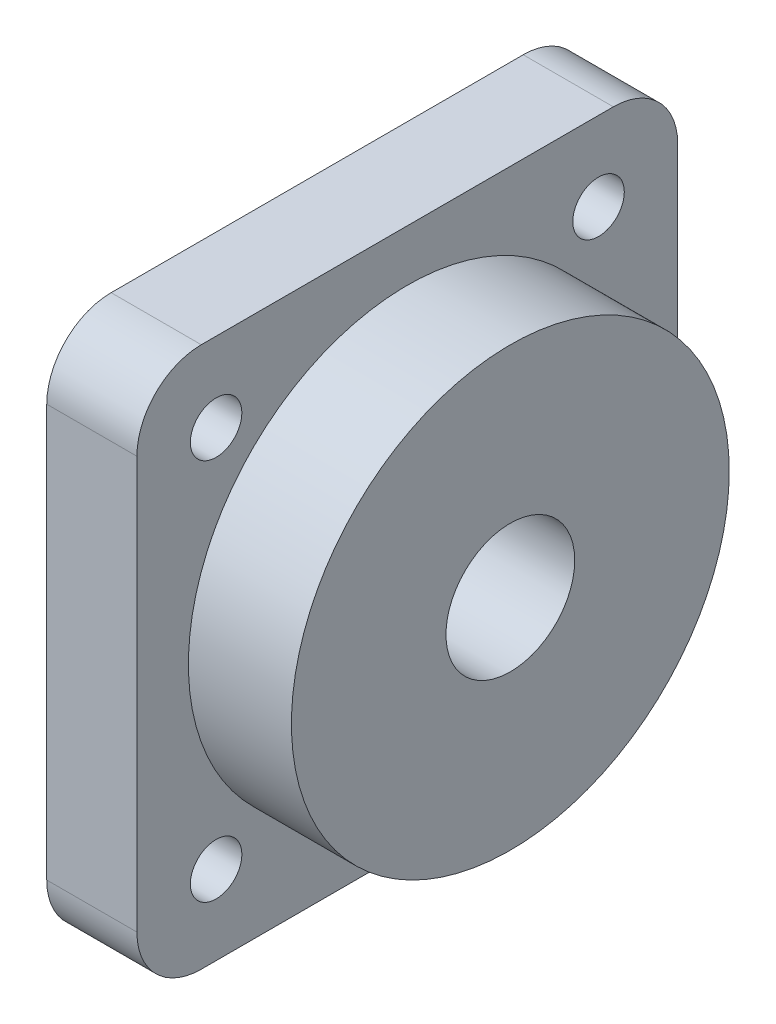
ISO-10303-21;
HEADER;
FILE_DESCRIPTION(('STEP AP214'),'2;1');
FILE_NAME('part.step','',(''),(''),'','','');
FILE_SCHEMA(('AUTOMOTIVE_DESIGN { 1 0 10303 214 1 1 1 1 }'));
ENDSEC;
DATA;
#1=APPLICATION_CONTEXT('core data for automotive mechanical design processes');
#2=APPLICATION_PROTOCOL_DEFINITION('international standard','automotive_design',2000,#1);
#3=PRODUCT_CONTEXT('',#1,'mechanical');
#4=PRODUCT('Part','Part','',(#3));
#5=PRODUCT_RELATED_PRODUCT_CATEGORY('part','',(#4));
#6=PRODUCT_DEFINITION_FORMATION('','',#4);
#7=PRODUCT_DEFINITION_CONTEXT('part definition',#1,'design');
#8=PRODUCT_DEFINITION('design','',#6,#7);
#9=PRODUCT_DEFINITION_SHAPE('','',#8);
#10=(LENGTH_UNIT() NAMED_UNIT(*) SI_UNIT(.MILLI.,.METRE.));
#11=(NAMED_UNIT(*) PLANE_ANGLE_UNIT() SI_UNIT($,.RADIAN.));
#12=(NAMED_UNIT(*) SI_UNIT($,.STERADIAN.) SOLID_ANGLE_UNIT());
#13=UNCERTAINTY_MEASURE_WITH_UNIT(LENGTH_MEASURE(1.E-05),#10,'distance_accuracy_value','');
#14=(GEOMETRIC_REPRESENTATION_CONTEXT(3) GLOBAL_UNCERTAINTY_ASSIGNED_CONTEXT((#13)) GLOBAL_UNIT_ASSIGNED_CONTEXT((#10,
#11,#12)) REPRESENTATION_CONTEXT('',''));
#15=CARTESIAN_POINT('',(0.,0.,0.));
#16=DIRECTION('',(0.,0.,1.));
#17=DIRECTION('',(1.,0.,0.));
#18=AXIS2_PLACEMENT_3D('',#15,#16,#17);
#19=CARTESIAN_POINT('',(7.,0.,0.));
#20=DIRECTION('',(1.,0.,0.));
#21=DIRECTION('',(0.,0.,-1.));
#22=AXIS2_PLACEMENT_3D('',#19,#20,#21);
#23=PLANE('',#22);
#24=CARTESIAN_POINT('',(7.,-14.8492424049175,-14.8492424049175));
#25=DIRECTION('',(1.,0.,0.));
#26=DIRECTION('',(0.,0.,-1.));
#27=AXIS2_PLACEMENT_3D('',#24,#25,#26);
#28=CIRCLE('',#27,2.);
#29=CARTESIAN_POINT('',(7.,-14.8492424049175,-16.8492424049175));
#30=VERTEX_POINT('',#29);
#31=EDGE_CURVE('E185',#30,#30,#28,.T.);
#32=ORIENTED_EDGE('',*,*,#31,.F.);
#33=EDGE_LOOP('',(#32));
#34=FACE_BOUND('',#33,.T.);
#35=CARTESIAN_POINT('',(7.,14.8492424049175,14.8492424049175));
#36=DIRECTION('',(1.,0.,0.));
#37=DIRECTION('',(0.,0.,-1.));
#38=AXIS2_PLACEMENT_3D('',#35,#36,#37);
#39=CIRCLE('',#38,2.);
#40=CARTESIAN_POINT('',(7.,14.8492424049175,12.8492424049175));
#41=VERTEX_POINT('',#40);
#42=EDGE_CURVE('E126',#41,#41,#39,.T.);
#43=ORIENTED_EDGE('',*,*,#42,.F.);
#44=EDGE_LOOP('',(#43));
#45=FACE_BOUND('',#44,.T.);
#46=DIRECTION('',(0.,0.,1.));
#47=VECTOR('',#46,1.);
#48=CARTESIAN_POINT('',(7.,21.,-21.));
#49=LINE('',#48,#47);
#50=CARTESIAN_POINT('',(7.,21.,-16.));
#51=VERTEX_POINT('',#50);
#52=CARTESIAN_POINT('',(7.,21.,16.));
#53=VERTEX_POINT('',#52);
#54=EDGE_CURVE('E135',#51,#53,#49,.T.);
#55=ORIENTED_EDGE('',*,*,#54,.T.);
#56=CARTESIAN_POINT('',(7.,16.,16.));
#57=DIRECTION('',(1.,0.,0.));
#58=DIRECTION('',(0.,0.,-1.));
#59=AXIS2_PLACEMENT_3D('',#56,#57,#58);
#60=CIRCLE('',#59,5.);
#61=CARTESIAN_POINT('',(7.,16.,21.));
#62=VERTEX_POINT('',#61);
#63=EDGE_CURVE('E154',#53,#62,#60,.T.);
#64=ORIENTED_EDGE('',*,*,#63,.T.);
#65=DIRECTION('',(0.,-1.,0.));
#66=VECTOR('',#65,1.);
#67=CARTESIAN_POINT('',(7.,-21.,21.));
#68=LINE('',#67,#66);
#69=CARTESIAN_POINT('',(7.,-16.,21.));
#70=VERTEX_POINT('',#69);
#71=EDGE_CURVE('E118',#62,#70,#68,.T.);
#72=ORIENTED_EDGE('',*,*,#71,.T.);
#73=CARTESIAN_POINT('',(7.,-16.,16.));
#74=DIRECTION('',(1.,0.,0.));
#75=DIRECTION('',(0.,0.,-1.));
#76=AXIS2_PLACEMENT_3D('',#73,#74,#75);
#77=CIRCLE('',#76,5.);
#78=CARTESIAN_POINT('',(7.,-21.,16.));
#79=VERTEX_POINT('',#78);
#80=EDGE_CURVE('E149',#70,#79,#77,.T.);
#81=ORIENTED_EDGE('',*,*,#80,.T.);
#82=DIRECTION('',(0.,0.,-1.));
#83=VECTOR('',#82,1.);
#84=CARTESIAN_POINT('',(7.,-21.,-21.));
#85=LINE('',#84,#83);
#86=CARTESIAN_POINT('',(7.,-21.,-16.));
#87=VERTEX_POINT('',#86);
#88=EDGE_CURVE('E165',#79,#87,#85,.T.);
#89=ORIENTED_EDGE('',*,*,#88,.T.);
#90=CARTESIAN_POINT('',(7.,-16.,-16.));
#91=DIRECTION('',(1.,0.,0.));
#92=DIRECTION('',(0.,0.,-1.));
#93=AXIS2_PLACEMENT_3D('',#90,#91,#92);
#94=CIRCLE('',#93,5.);
#95=CARTESIAN_POINT('',(7.,-16.,-21.));
#96=VERTEX_POINT('',#95);
#97=EDGE_CURVE('E54',#87,#96,#94,.T.);
#98=ORIENTED_EDGE('',*,*,#97,.T.);
#99=DIRECTION('',(0.,1.,0.));
#100=VECTOR('',#99,1.);
#101=CARTESIAN_POINT('',(7.,-21.,-21.));
#102=LINE('',#101,#100);
#103=CARTESIAN_POINT('',(7.,16.,-21.));
#104=VERTEX_POINT('',#103);
#105=EDGE_CURVE('E173',#96,#104,#102,.T.);
#106=ORIENTED_EDGE('',*,*,#105,.T.);
#107=CARTESIAN_POINT('',(7.,16.,-16.));
#108=DIRECTION('',(1.,0.,0.));
#109=DIRECTION('',(0.,0.,-1.));
#110=AXIS2_PLACEMENT_3D('',#107,#108,#109);
#111=CIRCLE('',#110,5.);
#112=EDGE_CURVE('E152',#104,#51,#111,.T.);
#113=ORIENTED_EDGE('',*,*,#112,.T.);
#114=EDGE_LOOP('',(#55,#64,#72,#81,#89,#98,#106,#113));
#115=FACE_BOUND('',#114,.T.);
#116=CARTESIAN_POINT('',(7.,14.8492424049175,-14.8492424049175));
#117=DIRECTION('',(1.,0.,0.));
#118=DIRECTION('',(0.,0.,-1.));
#119=AXIS2_PLACEMENT_3D('',#116,#117,#118);
#120=CIRCLE('',#119,2.);
#121=CARTESIAN_POINT('',(7.,14.8492424049175,-16.8492424049175));
#122=VERTEX_POINT('',#121);
#123=EDGE_CURVE('E180',#122,#122,#120,.T.);
#124=ORIENTED_EDGE('',*,*,#123,.F.);
#125=EDGE_LOOP('',(#124));
#126=FACE_BOUND('',#125,.T.);
#127=CARTESIAN_POINT('',(7.,-14.8492424049175,14.8492424049175));
#128=DIRECTION('',(1.,0.,0.));
#129=DIRECTION('',(0.,0.,-1.));
#130=AXIS2_PLACEMENT_3D('',#127,#128,#129);
#131=CIRCLE('',#130,2.);
#132=CARTESIAN_POINT('',(7.,-14.8492424049175,12.8492424049175));
#133=VERTEX_POINT('',#132);
#134=EDGE_CURVE('E191',#133,#133,#131,.T.);
#135=ORIENTED_EDGE('',*,*,#134,.F.);
#136=EDGE_LOOP('',(#135));
#137=FACE_BOUND('',#136,.T.);
#138=CARTESIAN_POINT('',(7.,0.,0.));
#139=DIRECTION('',(1.,0.,0.));
#140=DIRECTION('',(0.,0.,-1.));
#141=AXIS2_PLACEMENT_3D('',#138,#139,#140);
#142=CIRCLE('',#141,17.);
#143=CARTESIAN_POINT('',(7.,0.,-17.));
#144=VERTEX_POINT('',#143);
#145=EDGE_CURVE('E197',#144,#144,#142,.F.);
#146=ORIENTED_EDGE('',*,*,#145,.T.);
#147=EDGE_LOOP('',(#146));
#148=FACE_BOUND('',#147,.T.);
#149=ADVANCED_FACE('F32',(#34,#45,#115,#126,#137,#148),#23,.T.);
#150=CARTESIAN_POINT('',(0.,0.,0.));
#151=DIRECTION('',(1.,0.,0.));
#152=DIRECTION('',(0.,0.,-1.));
#153=AXIS2_PLACEMENT_3D('',#150,#151,#152);
#154=PLANE('',#153);
#155=CARTESIAN_POINT('',(0.,0.,0.));
#156=DIRECTION('',(1.,0.,0.));
#157=DIRECTION('',(0.,0.,-1.));
#158=AXIS2_PLACEMENT_3D('',#155,#156,#157);
#159=CIRCLE('',#158,5.);
#160=CARTESIAN_POINT('',(0.,0.,-5.));
#161=VERTEX_POINT('',#160);
#162=EDGE_CURVE('E206',#161,#161,#159,.T.);
#163=ORIENTED_EDGE('',*,*,#162,.T.);
#164=EDGE_LOOP('',(#163));
#165=FACE_BOUND('',#164,.T.);
#166=CARTESIAN_POINT('',(0.,-14.8492424049175,-14.8492424049175));
#167=DIRECTION('',(1.,0.,0.));
#168=DIRECTION('',(0.,0.,-1.));
#169=AXIS2_PLACEMENT_3D('',#166,#167,#168);
#170=CIRCLE('',#169,2.);
#171=CARTESIAN_POINT('',(0.,-14.8492424049175,-16.8492424049175));
#172=VERTEX_POINT('',#171);
#173=EDGE_CURVE('E188',#172,#172,#170,.T.);
#174=ORIENTED_EDGE('',*,*,#173,.T.);
#175=EDGE_LOOP('',(#174));
#176=FACE_BOUND('',#175,.T.);
#177=CARTESIAN_POINT('',(0.,14.8492424049175,14.8492424049175));
#178=DIRECTION('',(1.,0.,0.));
#179=DIRECTION('',(0.,0.,-1.));
#180=AXIS2_PLACEMENT_3D('',#177,#178,#179);
#181=CIRCLE('',#180,2.);
#182=CARTESIAN_POINT('',(0.,14.8492424049175,12.8492424049175));
#183=VERTEX_POINT('',#182);
#184=EDGE_CURVE('E132',#183,#183,#181,.T.);
#185=ORIENTED_EDGE('',*,*,#184,.T.);
#186=EDGE_LOOP('',(#185));
#187=FACE_BOUND('',#186,.T.);
#188=DIRECTION('',(0.,-1.,0.));
#189=VECTOR('',#188,1.);
#190=CARTESIAN_POINT('',(0.,-21.,21.));
#191=LINE('',#190,#189);
#192=CARTESIAN_POINT('',(0.,16.,21.));
#193=VERTEX_POINT('',#192);
#194=CARTESIAN_POINT('',(0.,-16.,21.));
#195=VERTEX_POINT('',#194);
#196=EDGE_CURVE('E115',#193,#195,#191,.T.);
#197=ORIENTED_EDGE('',*,*,#196,.F.);
#198=CARTESIAN_POINT('',(0.,16.,16.));
#199=DIRECTION('',(1.,0.,0.));
#200=DIRECTION('',(0.,0.,-1.));
#201=AXIS2_PLACEMENT_3D('',#198,#199,#200);
#202=CIRCLE('',#201,5.);
#203=CARTESIAN_POINT('',(0.,21.,16.));
#204=VERTEX_POINT('',#203);
#205=EDGE_CURVE('E98',#193,#204,#202,.F.);
#206=ORIENTED_EDGE('',*,*,#205,.T.);
#207=DIRECTION('',(0.,0.,1.));
#208=VECTOR('',#207,1.);
#209=CARTESIAN_POINT('',(0.,21.,-21.));
#210=LINE('',#209,#208);
#211=CARTESIAN_POINT('',(0.,21.,-16.));
#212=VERTEX_POINT('',#211);
#213=EDGE_CURVE('E139',#212,#204,#210,.T.);
#214=ORIENTED_EDGE('',*,*,#213,.F.);
#215=CARTESIAN_POINT('',(0.,16.,-16.));
#216=DIRECTION('',(1.,0.,0.));
#217=DIRECTION('',(0.,0.,-1.));
#218=AXIS2_PLACEMENT_3D('',#215,#216,#217);
#219=CIRCLE('',#218,5.);
#220=CARTESIAN_POINT('',(0.,16.,-21.));
#221=VERTEX_POINT('',#220);
#222=EDGE_CURVE('E109',#212,#221,#219,.F.);
#223=ORIENTED_EDGE('',*,*,#222,.T.);
#224=DIRECTION('',(0.,1.,0.));
#225=VECTOR('',#224,1.);
#226=CARTESIAN_POINT('',(0.,-21.,-21.));
#227=LINE('',#226,#225);
#228=CARTESIAN_POINT('',(0.,-16.,-21.));
#229=VERTEX_POINT('',#228);
#230=EDGE_CURVE('E129',#229,#221,#227,.T.);
#231=ORIENTED_EDGE('',*,*,#230,.F.);
#232=CARTESIAN_POINT('',(0.,-16.,-16.));
#233=DIRECTION('',(1.,0.,0.));
#234=DIRECTION('',(0.,0.,-1.));
#235=AXIS2_PLACEMENT_3D('',#232,#233,#234);
#236=CIRCLE('',#235,5.);
#237=CARTESIAN_POINT('',(0.,-21.,-16.));
#238=VERTEX_POINT('',#237);
#239=EDGE_CURVE('E143',#229,#238,#236,.F.);
#240=ORIENTED_EDGE('',*,*,#239,.T.);
#241=DIRECTION('',(0.,0.,-1.));
#242=VECTOR('',#241,1.);
#243=CARTESIAN_POINT('',(0.,-21.,-21.));
#244=LINE('',#243,#242);
#245=CARTESIAN_POINT('',(0.,-21.,16.));
#246=VERTEX_POINT('',#245);
#247=EDGE_CURVE('E125',#246,#238,#244,.T.);
#248=ORIENTED_EDGE('',*,*,#247,.F.);
#249=CARTESIAN_POINT('',(0.,-16.,16.));
#250=DIRECTION('',(1.,0.,0.));
#251=DIRECTION('',(0.,0.,-1.));
#252=AXIS2_PLACEMENT_3D('',#249,#250,#251);
#253=CIRCLE('',#252,5.);
#254=EDGE_CURVE('E119',#246,#195,#253,.F.);
#255=ORIENTED_EDGE('',*,*,#254,.T.);
#256=EDGE_LOOP('',(#197,#206,#214,#223,#231,#240,#248,#255));
#257=FACE_BOUND('',#256,.T.);
#258=CARTESIAN_POINT('',(0.,14.8492424049175,-14.8492424049175));
#259=DIRECTION('',(1.,0.,0.));
#260=DIRECTION('',(0.,0.,-1.));
#261=AXIS2_PLACEMENT_3D('',#258,#259,#260);
#262=CIRCLE('',#261,2.);
#263=CARTESIAN_POINT('',(0.,14.8492424049175,-16.8492424049175));
#264=VERTEX_POINT('',#263);
#265=EDGE_CURVE('E182',#264,#264,#262,.T.);
#266=ORIENTED_EDGE('',*,*,#265,.T.);
#267=EDGE_LOOP('',(#266));
#268=FACE_BOUND('',#267,.T.);
#269=CARTESIAN_POINT('',(0.,-14.8492424049175,14.8492424049175));
#270=DIRECTION('',(1.,0.,0.));
#271=DIRECTION('',(0.,0.,-1.));
#272=AXIS2_PLACEMENT_3D('',#269,#270,#271);
#273=CIRCLE('',#272,2.);
#274=CARTESIAN_POINT('',(0.,-14.8492424049175,12.8492424049175));
#275=VERTEX_POINT('',#274);
#276=EDGE_CURVE('E194',#275,#275,#273,.T.);
#277=ORIENTED_EDGE('',*,*,#276,.T.);
#278=EDGE_LOOP('',(#277));
#279=FACE_BOUND('',#278,.T.);
#280=ADVANCED_FACE('F122',(#165,#176,#187,#257,#268,#279),#154,.F.);
#281=CARTESIAN_POINT('',(7.,-21.,21.));
#282=DIRECTION('',(0.,0.,-1.));
#283=DIRECTION('',(-1.,0.,0.));
#284=AXIS2_PLACEMENT_3D('',#281,#282,#283);
#285=PLANE('',#284);
#286=ORIENTED_EDGE('',*,*,#71,.F.);
#287=DIRECTION('',(-1.,0.,0.));
#288=VECTOR('',#287,1.);
#289=CARTESIAN_POINT('',(7.,16.,21.));
#290=LINE('',#289,#288);
#291=EDGE_CURVE('E102',#62,#193,#290,.T.);
#292=ORIENTED_EDGE('',*,*,#291,.T.);
#293=ORIENTED_EDGE('',*,*,#196,.T.);
#294=DIRECTION('',(-1.,0.,0.));
#295=VECTOR('',#294,1.);
#296=CARTESIAN_POINT('',(7.,-16.,21.));
#297=LINE('',#296,#295);
#298=EDGE_CURVE('E120',#195,#70,#297,.F.);
#299=ORIENTED_EDGE('',*,*,#298,.T.);
#300=EDGE_LOOP('',(#286,#292,#293,#299));
#301=FACE_BOUND('',#300,.T.);
#302=ADVANCED_FACE('F114',(#301),#285,.F.);
#303=CARTESIAN_POINT('',(7.,-21.,-21.));
#304=DIRECTION('',(0.,1.,0.));
#305=DIRECTION('',(0.,0.,1.));
#306=AXIS2_PLACEMENT_3D('',#303,#304,#305);
#307=PLANE('',#306);
#308=ORIENTED_EDGE('',*,*,#247,.T.);
#309=DIRECTION('',(-1.,0.,0.));
#310=VECTOR('',#309,1.);
#311=CARTESIAN_POINT('',(7.,-21.,-16.));
#312=LINE('',#311,#310);
#313=EDGE_CURVE('E11',#238,#87,#312,.F.);
#314=ORIENTED_EDGE('',*,*,#313,.T.);
#315=ORIENTED_EDGE('',*,*,#88,.F.);
#316=DIRECTION('',(-1.,0.,0.));
#317=VECTOR('',#316,1.);
#318=CARTESIAN_POINT('',(7.,-21.,16.));
#319=LINE('',#318,#317);
#320=EDGE_CURVE('E40',#79,#246,#319,.T.);
#321=ORIENTED_EDGE('',*,*,#320,.T.);
#322=EDGE_LOOP('',(#308,#314,#315,#321));
#323=FACE_BOUND('',#322,.T.);
#324=ADVANCED_FACE('F163',(#323),#307,.F.);
#325=CARTESIAN_POINT('',(7.,-21.,-21.));
#326=DIRECTION('',(0.,0.,1.));
#327=DIRECTION('',(0.,-1.,0.));
#328=AXIS2_PLACEMENT_3D('',#325,#326,#327);
#329=PLANE('',#328);
#330=ORIENTED_EDGE('',*,*,#230,.T.);
#331=DIRECTION('',(-1.,0.,0.));
#332=VECTOR('',#331,1.);
#333=CARTESIAN_POINT('',(7.,16.,-21.));
#334=LINE('',#333,#332);
#335=EDGE_CURVE('E47',#221,#104,#334,.F.);
#336=ORIENTED_EDGE('',*,*,#335,.T.);
#337=ORIENTED_EDGE('',*,*,#105,.F.);
#338=DIRECTION('',(-1.,0.,0.));
#339=VECTOR('',#338,1.);
#340=CARTESIAN_POINT('',(7.,-16.,-21.));
#341=LINE('',#340,#339);
#342=EDGE_CURVE('E156',#96,#229,#341,.T.);
#343=ORIENTED_EDGE('',*,*,#342,.T.);
#344=EDGE_LOOP('',(#330,#336,#337,#343));
#345=FACE_BOUND('',#344,.T.);
#346=ADVANCED_FACE('F172',(#345),#329,.F.);
#347=CARTESIAN_POINT('',(7.,21.,-21.));
#348=DIRECTION('',(0.,-1.,0.));
#349=DIRECTION('',(0.,0.,-1.));
#350=AXIS2_PLACEMENT_3D('',#347,#348,#349);
#351=PLANE('',#350);
#352=ORIENTED_EDGE('',*,*,#213,.T.);
#353=DIRECTION('',(-1.,0.,0.));
#354=VECTOR('',#353,1.);
#355=CARTESIAN_POINT('',(7.,21.,16.));
#356=LINE('',#355,#354);
#357=EDGE_CURVE('E103',#204,#53,#356,.F.);
#358=ORIENTED_EDGE('',*,*,#357,.T.);
#359=ORIENTED_EDGE('',*,*,#54,.F.);
#360=DIRECTION('',(-1.,0.,0.));
#361=VECTOR('',#360,1.);
#362=CARTESIAN_POINT('',(7.,21.,-16.));
#363=LINE('',#362,#361);
#364=EDGE_CURVE('E108',#51,#212,#363,.T.);
#365=ORIENTED_EDGE('',*,*,#364,.T.);
#366=EDGE_LOOP('',(#352,#358,#359,#365));
#367=FACE_BOUND('',#366,.T.);
#368=ADVANCED_FACE('F245',(#367),#351,.F.);
#369=CARTESIAN_POINT('',(7.,14.8492424049175,14.8492424049175));
#370=DIRECTION('',(-1.,0.,0.));
#371=DIRECTION('',(0.,0.,1.));
#372=AXIS2_PLACEMENT_3D('',#369,#370,#371);
#373=CYLINDRICAL_SURFACE('',#372,2.);
#374=ORIENTED_EDGE('',*,*,#42,.T.);
#375=EDGE_LOOP('',(#374));
#376=FACE_BOUND('',#375,.T.);
#377=ORIENTED_EDGE('',*,*,#184,.F.);
#378=EDGE_LOOP('',(#377));
#379=FACE_BOUND('',#378,.T.);
#380=ADVANCED_FACE('F242',(#376,#379),#373,.F.);
#381=CARTESIAN_POINT('',(7.,14.8492424049175,-14.8492424049175));
#382=DIRECTION('',(-1.,0.,0.));
#383=DIRECTION('',(0.,0.,1.));
#384=AXIS2_PLACEMENT_3D('',#381,#382,#383);
#385=CYLINDRICAL_SURFACE('',#384,2.);
#386=ORIENTED_EDGE('',*,*,#123,.T.);
#387=EDGE_LOOP('',(#386));
#388=FACE_BOUND('',#387,.T.);
#389=ORIENTED_EDGE('',*,*,#265,.F.);
#390=EDGE_LOOP('',(#389));
#391=FACE_BOUND('',#390,.T.);
#392=ADVANCED_FACE('F280',(#388,#391),#385,.F.);
#393=CARTESIAN_POINT('',(7.,-14.8492424049175,-14.8492424049175));
#394=DIRECTION('',(-1.,0.,0.));
#395=DIRECTION('',(0.,0.,1.));
#396=AXIS2_PLACEMENT_3D('',#393,#394,#395);
#397=CYLINDRICAL_SURFACE('',#396,2.);
#398=ORIENTED_EDGE('',*,*,#31,.T.);
#399=EDGE_LOOP('',(#398));
#400=FACE_BOUND('',#399,.T.);
#401=ORIENTED_EDGE('',*,*,#173,.F.);
#402=EDGE_LOOP('',(#401));
#403=FACE_BOUND('',#402,.T.);
#404=ADVANCED_FACE('F227',(#400,#403),#397,.F.);
#405=CARTESIAN_POINT('',(7.,-14.8492424049175,14.8492424049175));
#406=DIRECTION('',(-1.,0.,0.));
#407=DIRECTION('',(0.,0.,1.));
#408=AXIS2_PLACEMENT_3D('',#405,#406,#407);
#409=CYLINDRICAL_SURFACE('',#408,2.);
#410=ORIENTED_EDGE('',*,*,#134,.T.);
#411=EDGE_LOOP('',(#410));
#412=FACE_BOUND('',#411,.T.);
#413=ORIENTED_EDGE('',*,*,#276,.F.);
#414=EDGE_LOOP('',(#413));
#415=FACE_BOUND('',#414,.T.);
#416=ADVANCED_FACE('F218',(#412,#415),#409,.F.);
#417=CARTESIAN_POINT('',(15.,0.,0.));
#418=DIRECTION('',(1.,0.,0.));
#419=DIRECTION('',(0.,0.,-1.));
#420=AXIS2_PLACEMENT_3D('',#417,#418,#419);
#421=PLANE('',#420);
#422=CARTESIAN_POINT('',(15.,0.,0.));
#423=DIRECTION('',(1.,0.,0.));
#424=DIRECTION('',(0.,0.,-1.));
#425=AXIS2_PLACEMENT_3D('',#422,#423,#424);
#426=CIRCLE('',#425,17.);
#427=CARTESIAN_POINT('',(15.,0.,-17.));
#428=VERTEX_POINT('',#427);
#429=EDGE_CURVE('E202',#428,#428,#426,.T.);
#430=ORIENTED_EDGE('',*,*,#429,.T.);
#431=EDGE_LOOP('',(#430));
#432=FACE_BOUND('',#431,.T.);
#433=CARTESIAN_POINT('',(15.,0.,0.));
#434=DIRECTION('',(1.,0.,0.));
#435=DIRECTION('',(0.,0.,-1.));
#436=AXIS2_PLACEMENT_3D('',#433,#434,#435);
#437=CIRCLE('',#436,5.);
#438=CARTESIAN_POINT('',(15.,0.,-5.));
#439=VERTEX_POINT('',#438);
#440=EDGE_CURVE('E205',#439,#439,#437,.T.);
#441=ORIENTED_EDGE('',*,*,#440,.F.);
#442=EDGE_LOOP('',(#441));
#443=FACE_BOUND('',#442,.T.);
#444=ADVANCED_FACE('F215',(#432,#443),#421,.T.);
#445=CARTESIAN_POINT('',(15.,0.,0.));
#446=DIRECTION('',(-1.,0.,0.));
#447=DIRECTION('',(0.,0.,1.));
#448=AXIS2_PLACEMENT_3D('',#445,#446,#447);
#449=CYLINDRICAL_SURFACE('',#448,17.);
#450=ORIENTED_EDGE('',*,*,#145,.F.);
#451=EDGE_LOOP('',(#450));
#452=FACE_BOUND('',#451,.T.);
#453=ORIENTED_EDGE('',*,*,#429,.F.);
#454=EDGE_LOOP('',(#453));
#455=FACE_BOUND('',#454,.T.);
#456=ADVANCED_FACE('F217',(#452,#455),#449,.T.);
#457=CARTESIAN_POINT('',(15.,0.,0.));
#458=DIRECTION('',(-1.,0.,0.));
#459=DIRECTION('',(0.,0.,1.));
#460=AXIS2_PLACEMENT_3D('',#457,#458,#459);
#461=CYLINDRICAL_SURFACE('',#460,5.);
#462=ORIENTED_EDGE('',*,*,#440,.T.);
#463=EDGE_LOOP('',(#462));
#464=FACE_BOUND('',#463,.T.);
#465=ORIENTED_EDGE('',*,*,#162,.F.);
#466=EDGE_LOOP('',(#465));
#467=FACE_BOUND('',#466,.T.);
#468=ADVANCED_FACE('F212',(#464,#467),#461,.F.);
#469=CARTESIAN_POINT('',(7.,16.,16.));
#470=DIRECTION('',(-1.,0.,0.));
#471=DIRECTION('',(0.,0.,1.));
#472=AXIS2_PLACEMENT_3D('',#469,#470,#471);
#473=CYLINDRICAL_SURFACE('',#472,5.);
#474=ORIENTED_EDGE('',*,*,#63,.F.);
#475=ORIENTED_EDGE('',*,*,#357,.F.);
#476=ORIENTED_EDGE('',*,*,#205,.F.);
#477=ORIENTED_EDGE('',*,*,#291,.F.);
#478=EDGE_LOOP('',(#474,#475,#476,#477));
#479=FACE_BOUND('',#478,.T.);
#480=ADVANCED_FACE('F101',(#479),#473,.T.);
#481=CARTESIAN_POINT('',(7.,16.,-16.));
#482=DIRECTION('',(-1.,0.,0.));
#483=DIRECTION('',(0.,0.,1.));
#484=AXIS2_PLACEMENT_3D('',#481,#482,#483);
#485=CYLINDRICAL_SURFACE('',#484,5.);
#486=ORIENTED_EDGE('',*,*,#112,.F.);
#487=ORIENTED_EDGE('',*,*,#335,.F.);
#488=ORIENTED_EDGE('',*,*,#222,.F.);
#489=ORIENTED_EDGE('',*,*,#364,.F.);
#490=EDGE_LOOP('',(#486,#487,#488,#489));
#491=FACE_BOUND('',#490,.T.);
#492=ADVANCED_FACE('F257',(#491),#485,.T.);
#493=CARTESIAN_POINT('',(7.,-16.,-16.));
#494=DIRECTION('',(-1.,0.,0.));
#495=DIRECTION('',(0.,0.,1.));
#496=AXIS2_PLACEMENT_3D('',#493,#494,#495);
#497=CYLINDRICAL_SURFACE('',#496,5.);
#498=ORIENTED_EDGE('',*,*,#97,.F.);
#499=ORIENTED_EDGE('',*,*,#313,.F.);
#500=ORIENTED_EDGE('',*,*,#239,.F.);
#501=ORIENTED_EDGE('',*,*,#342,.F.);
#502=EDGE_LOOP('',(#498,#499,#500,#501));
#503=FACE_BOUND('',#502,.T.);
#504=ADVANCED_FACE('F171',(#503),#497,.T.);
#505=CARTESIAN_POINT('',(7.,-16.,16.));
#506=DIRECTION('',(-1.,0.,0.));
#507=DIRECTION('',(0.,0.,1.));
#508=AXIS2_PLACEMENT_3D('',#505,#506,#507);
#509=CYLINDRICAL_SURFACE('',#508,5.);
#510=ORIENTED_EDGE('',*,*,#80,.F.);
#511=ORIENTED_EDGE('',*,*,#298,.F.);
#512=ORIENTED_EDGE('',*,*,#254,.F.);
#513=ORIENTED_EDGE('',*,*,#320,.F.);
#514=EDGE_LOOP('',(#510,#511,#512,#513));
#515=FACE_BOUND('',#514,.T.);
#516=ADVANCED_FACE('F34',(#515),#509,.T.);
#517=CLOSED_SHELL('',(#149,#280,#302,#324,#346,#368,#380,#392,#404,#416,#444,#456,#468,#480,
#492,#504,#516));
#518=MANIFOLD_SOLID_BREP('B2',#517);
#519=ADVANCED_BREP_SHAPE_REPRESENTATION('',(#18,#518),#14);
#520=SHAPE_DEFINITION_REPRESENTATION(#9,#519);
ENDSEC;
END-ISO-10303-21;
